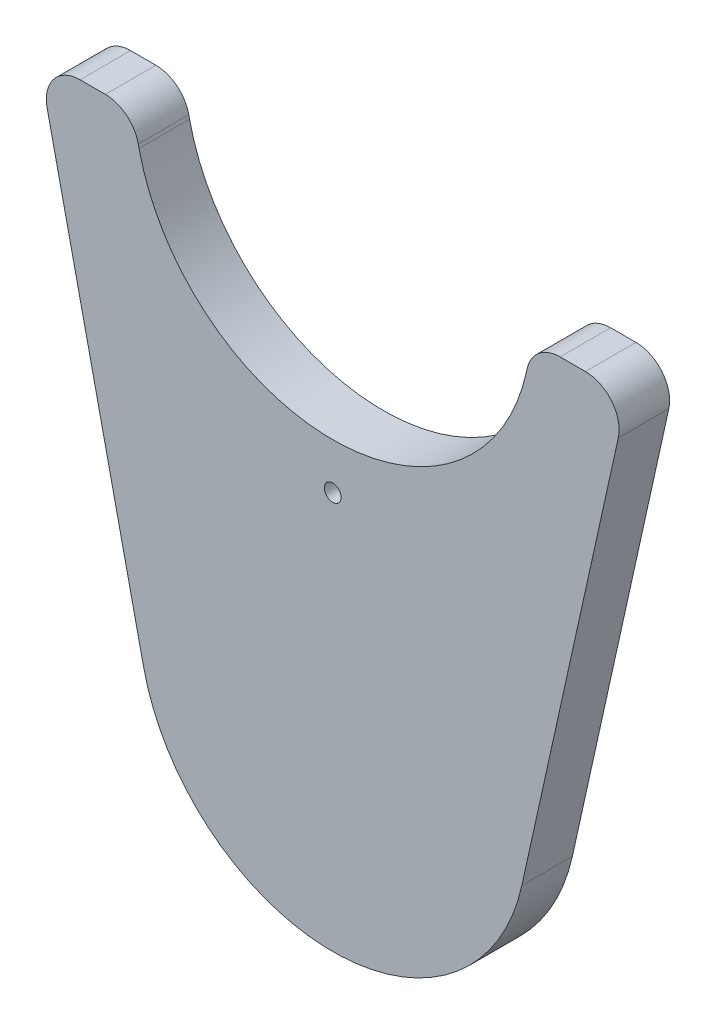
ISO-10303-21;
HEADER;
FILE_DESCRIPTION(('STEP AP214'),'2;1');
FILE_NAME('part.step','',(''),(''),'','','');
FILE_SCHEMA(('AUTOMOTIVE_DESIGN { 1 0 10303 214 1 1 1 1 }'));
ENDSEC;
DATA;
#1=APPLICATION_CONTEXT('core data for automotive mechanical design processes');
#2=APPLICATION_PROTOCOL_DEFINITION('international standard','automotive_design',2000,#1);
#3=PRODUCT_CONTEXT('',#1,'mechanical');
#4=PRODUCT('Part','Part','',(#3));
#5=PRODUCT_RELATED_PRODUCT_CATEGORY('part','',(#4));
#6=PRODUCT_DEFINITION_FORMATION('','',#4);
#7=PRODUCT_DEFINITION_CONTEXT('part definition',#1,'design');
#8=PRODUCT_DEFINITION('design','',#6,#7);
#9=PRODUCT_DEFINITION_SHAPE('','',#8);
#10=(LENGTH_UNIT() NAMED_UNIT(*) SI_UNIT(.MILLI.,.METRE.));
#11=(NAMED_UNIT(*) PLANE_ANGLE_UNIT() SI_UNIT($,.RADIAN.));
#12=(NAMED_UNIT(*) SI_UNIT($,.STERADIAN.) SOLID_ANGLE_UNIT());
#13=UNCERTAINTY_MEASURE_WITH_UNIT(LENGTH_MEASURE(1.E-05),#10,'distance_accuracy_value','');
#14=(GEOMETRIC_REPRESENTATION_CONTEXT(3) GLOBAL_UNCERTAINTY_ASSIGNED_CONTEXT((#13)) GLOBAL_UNIT_ASSIGNED_CONTEXT((#10,
#11,#12)) REPRESENTATION_CONTEXT('',''));
#15=CARTESIAN_POINT('',(0.,0.,0.));
#16=DIRECTION('',(0.,0.,1.));
#17=DIRECTION('',(1.,0.,0.));
#18=AXIS2_PLACEMENT_3D('',#15,#16,#17);
#19=CARTESIAN_POINT('',(0.,0.,15.));
#20=DIRECTION('',(0.,0.,1.));
#21=DIRECTION('',(1.,0.,0.));
#22=AXIS2_PLACEMENT_3D('',#19,#20,#21);
#23=PLANE('',#22);
#24=CARTESIAN_POINT('',(0.,0.,15.));
#25=DIRECTION('',(0.,0.,1.));
#26=DIRECTION('',(1.,0.,0.));
#27=AXIS2_PLACEMENT_3D('',#24,#25,#26);
#28=CIRCLE('',#27,57.5);
#29=CARTESIAN_POINT('',(-56.1416428716496,-12.4244088661055,15.));
#30=VERTEX_POINT('',#29);
#31=CARTESIAN_POINT('',(56.1416428716495,-12.4244088661059,15.));
#32=VERTEX_POINT('',#31);
#33=EDGE_CURVE('E177',#30,#32,#28,.T.);
#34=ORIENTED_EDGE('',*,*,#33,.T.);
#35=DIRECTION('',(0.216076675932276,0.976376397767817,0.));
#36=VECTOR('',#35,1.);
#37=CARTESIAN_POINT('',(56.1416428716495,-12.4244088661059,15.));
#38=LINE('',#37,#36);
#39=CARTESIAN_POINT('',(84.7799694041554,116.982367581485,15.));
#40=VERTEX_POINT('',#39);
#41=EDGE_CURVE('E105',#32,#40,#38,.T.);
#42=ORIENTED_EDGE('',*,*,#41,.T.);
#43=CARTESIAN_POINT('',(75.0162054264772,119.143134340808,15.));
#44=DIRECTION('',(0.,0.,1.));
#45=DIRECTION('',(1.,0.,0.));
#46=AXIS2_PLACEMENT_3D('',#43,#44,#45);
#47=CIRCLE('',#46,10.);
#48=CARTESIAN_POINT('',(75.0162054264772,129.143134340808,15.));
#49=VERTEX_POINT('',#48);
#50=EDGE_CURVE('E204',#40,#49,#47,.T.);
#51=ORIENTED_EDGE('',*,*,#50,.T.);
#52=DIRECTION('',(-1.,0.,0.));
#53=VECTOR('',#52,1.);
#54=CARTESIAN_POINT('',(67.4944002792042,129.143134340808,15.));
#55=LINE('',#54,#53);
#56=CARTESIAN_POINT('',(67.4944002792042,129.143134340808,15.));
#57=VERTEX_POINT('',#56);
#58=EDGE_CURVE('E223',#49,#57,#55,.T.);
#59=ORIENTED_EDGE('',*,*,#58,.T.);
#60=CARTESIAN_POINT('',(67.4944002792041,119.143134340808,15.));
#61=DIRECTION('',(0.,0.,1.));
#62=DIRECTION('',(-1.,0.,0.));
#63=AXIS2_PLACEMENT_3D('',#60,#61,#62);
#64=CIRCLE('',#63,10.0000000000002);
#65=CARTESIAN_POINT('',(57.7306363015258,121.303901100131,15.));
#66=VERTEX_POINT('',#65);
#67=EDGE_CURVE('E220',#57,#66,#64,.T.);
#68=ORIENTED_EDGE('',*,*,#67,.T.);
#69=DIRECTION('',(-0.216076675932268,-0.976376397767819,0.));
#70=VECTOR('',#69,1.);
#71=CARTESIAN_POINT('',(57.5027711046817,120.274256419086,15.));
#72=LINE('',#71,#70);
#73=CARTESIAN_POINT('',(57.5027711046817,120.274256419086,15.));
#74=VERTEX_POINT('',#73);
#75=EDGE_CURVE('E222',#66,#74,#72,.T.);
#76=ORIENTED_EDGE('',*,*,#75,.T.);
#77=CARTESIAN_POINT('',(-0.0005,132.99999999906,15.));
#78=DIRECTION('',(0.,0.,-1.));
#79=DIRECTION('',(1.,0.,0.));
#80=AXIS2_PLACEMENT_3D('',#77,#78,#79);
#81=CIRCLE('',#80,58.8945730725826);
#82=CARTESIAN_POINT('',(-57.4972288953183,120.244730353144,15.));
#83=VERTEX_POINT('',#82);
#84=EDGE_CURVE('E225',#74,#83,#81,.T.);
#85=ORIENTED_EDGE('',*,*,#84,.T.);
#86=DIRECTION('',(-0.216076675932281,0.976376397767816,0.));
#87=VECTOR('',#86,1.);
#88=CARTESIAN_POINT('',(-57.4972288953183,120.244730353144,15.));
#89=LINE('',#88,#87);
#90=CARTESIAN_POINT('',(-57.73162834903,121.303901100131,15.));
#91=VERTEX_POINT('',#90);
#92=EDGE_CURVE('E231',#83,#91,#89,.T.);
#93=ORIENTED_EDGE('',*,*,#92,.T.);
#94=CARTESIAN_POINT('',(-67.495392326708,119.143134340808,15.));
#95=DIRECTION('',(0.,0.,1.));
#96=DIRECTION('',(1.,0.,0.));
#97=AXIS2_PLACEMENT_3D('',#94,#95,#96);
#98=CIRCLE('',#97,10.0000000000002);
#99=CARTESIAN_POINT('',(-67.4953923267081,129.143134340808,15.));
#100=VERTEX_POINT('',#99);
#101=EDGE_CURVE('E136',#91,#100,#98,.T.);
#102=ORIENTED_EDGE('',*,*,#101,.T.);
#103=DIRECTION('',(-1.,0.,0.));
#104=VECTOR('',#103,1.);
#105=CARTESIAN_POINT('',(-75.0162054264772,129.143134340808,15.));
#106=LINE('',#105,#104);
#107=CARTESIAN_POINT('',(-75.0162054264772,129.143134340808,15.));
#108=VERTEX_POINT('',#107);
#109=EDGE_CURVE('E130',#100,#108,#106,.T.);
#110=ORIENTED_EDGE('',*,*,#109,.T.);
#111=CARTESIAN_POINT('',(-75.0162054264772,119.143134340808,15.));
#112=DIRECTION('',(0.,0.,1.));
#113=DIRECTION('',(1.,0.,0.));
#114=AXIS2_PLACEMENT_3D('',#111,#112,#113);
#115=CIRCLE('',#114,10.);
#116=CARTESIAN_POINT('',(-84.7799694041553,116.982367581485,15.));
#117=VERTEX_POINT('',#116);
#118=EDGE_CURVE('E134',#108,#117,#115,.T.);
#119=ORIENTED_EDGE('',*,*,#118,.T.);
#120=DIRECTION('',(0.216076675932276,-0.976376397767817,0.));
#121=VECTOR('',#120,1.);
#122=CARTESIAN_POINT('',(-56.1416428716496,-12.4244088661055,15.));
#123=LINE('',#122,#121);
#124=EDGE_CURVE('E50',#117,#30,#123,.T.);
#125=ORIENTED_EDGE('',*,*,#124,.T.);
#126=EDGE_LOOP('',(#34,#42,#51,#59,#68,#76,#85,#93,#102,#110,#119,#125));
#127=FACE_BOUND('',#126,.T.);
#128=CARTESIAN_POINT('',(0.,60.5,15.));
#129=DIRECTION('',(0.,0.,1.));
#130=DIRECTION('',(1.,0.,0.));
#131=AXIS2_PLACEMENT_3D('',#128,#129,#130);
#132=CIRCLE('',#131,2.5);
#133=CARTESIAN_POINT('',(2.5,60.5,15.));
#134=VERTEX_POINT('',#133);
#135=EDGE_CURVE('E158',#134,#134,#132,.T.);
#136=ORIENTED_EDGE('',*,*,#135,.F.);
#137=EDGE_LOOP('',(#136));
#138=FACE_BOUND('',#137,.T.);
#139=ADVANCED_FACE('F33',(#127,#138),#23,.T.);
#140=CARTESIAN_POINT('',(0.,0.,0.));
#141=DIRECTION('',(0.,0.,1.));
#142=DIRECTION('',(1.,0.,0.));
#143=AXIS2_PLACEMENT_3D('',#140,#141,#142);
#144=PLANE('',#143);
#145=CARTESIAN_POINT('',(0.,0.,0.));
#146=DIRECTION('',(0.,0.,1.));
#147=DIRECTION('',(1.,0.,0.));
#148=AXIS2_PLACEMENT_3D('',#145,#146,#147);
#149=CIRCLE('',#148,57.5);
#150=CARTESIAN_POINT('',(-56.1416428716496,-12.4244088661055,0.));
#151=VERTEX_POINT('',#150);
#152=CARTESIAN_POINT('',(56.1416428716495,-12.4244088661059,0.));
#153=VERTEX_POINT('',#152);
#154=EDGE_CURVE('E154',#151,#153,#149,.T.);
#155=ORIENTED_EDGE('',*,*,#154,.F.);
#156=DIRECTION('',(0.216076675932276,-0.976376397767817,0.));
#157=VECTOR('',#156,1.);
#158=CARTESIAN_POINT('',(-56.1416428716496,-12.4244088661055,0.));
#159=LINE('',#158,#157);
#160=CARTESIAN_POINT('',(-84.7799694041553,116.982367581485,0.));
#161=VERTEX_POINT('',#160);
#162=EDGE_CURVE('E97',#161,#151,#159,.T.);
#163=ORIENTED_EDGE('',*,*,#162,.F.);
#164=CARTESIAN_POINT('',(-75.0162054264772,119.143134340808,0.));
#165=DIRECTION('',(0.,0.,1.));
#166=DIRECTION('',(1.,0.,0.));
#167=AXIS2_PLACEMENT_3D('',#164,#165,#166);
#168=CIRCLE('',#167,10.);
#169=CARTESIAN_POINT('',(-75.0162054264772,129.143134340808,0.));
#170=VERTEX_POINT('',#169);
#171=EDGE_CURVE('E91',#170,#161,#168,.T.);
#172=ORIENTED_EDGE('',*,*,#171,.F.);
#173=DIRECTION('',(-1.,0.,0.));
#174=VECTOR('',#173,1.);
#175=CARTESIAN_POINT('',(-75.0162054264772,129.143134340808,0.));
#176=LINE('',#175,#174);
#177=CARTESIAN_POINT('',(-67.4953923267081,129.143134340808,0.));
#178=VERTEX_POINT('',#177);
#179=EDGE_CURVE('E144',#178,#170,#176,.T.);
#180=ORIENTED_EDGE('',*,*,#179,.F.);
#181=CARTESIAN_POINT('',(-67.495392326708,119.143134340808,0.));
#182=DIRECTION('',(0.,0.,1.));
#183=DIRECTION('',(1.,0.,0.));
#184=AXIS2_PLACEMENT_3D('',#181,#182,#183);
#185=CIRCLE('',#184,10.0000000000002);
#186=CARTESIAN_POINT('',(-57.73162834903,121.303901100131,0.));
#187=VERTEX_POINT('',#186);
#188=EDGE_CURVE('E172',#187,#178,#185,.T.);
#189=ORIENTED_EDGE('',*,*,#188,.F.);
#190=DIRECTION('',(-0.216076675932281,0.976376397767816,0.));
#191=VECTOR('',#190,1.);
#192=CARTESIAN_POINT('',(-57.4972288953183,120.244730353144,0.));
#193=LINE('',#192,#191);
#194=CARTESIAN_POINT('',(-57.4972288953183,120.244730353144,0.));
#195=VERTEX_POINT('',#194);
#196=EDGE_CURVE('E170',#195,#187,#193,.T.);
#197=ORIENTED_EDGE('',*,*,#196,.F.);
#198=CARTESIAN_POINT('',(-0.0005,132.99999999906,0.));
#199=DIRECTION('',(0.,0.,-1.));
#200=DIRECTION('',(1.,0.,0.));
#201=AXIS2_PLACEMENT_3D('',#198,#199,#200);
#202=CIRCLE('',#201,58.8945730725826);
#203=CARTESIAN_POINT('',(57.5027711046817,120.274256419086,0.));
#204=VERTEX_POINT('',#203);
#205=EDGE_CURVE('E168',#204,#195,#202,.T.);
#206=ORIENTED_EDGE('',*,*,#205,.F.);
#207=DIRECTION('',(-0.216076675932268,-0.976376397767819,0.));
#208=VECTOR('',#207,1.);
#209=CARTESIAN_POINT('',(57.5027711046817,120.274256419086,0.));
#210=LINE('',#209,#208);
#211=CARTESIAN_POINT('',(57.7306363015258,121.303901100131,0.));
#212=VERTEX_POINT('',#211);
#213=EDGE_CURVE('E166',#212,#204,#210,.T.);
#214=ORIENTED_EDGE('',*,*,#213,.F.);
#215=CARTESIAN_POINT('',(67.4944002792041,119.143134340808,0.));
#216=DIRECTION('',(0.,0.,1.));
#217=DIRECTION('',(-1.,0.,0.));
#218=AXIS2_PLACEMENT_3D('',#215,#216,#217);
#219=CIRCLE('',#218,10.0000000000002);
#220=CARTESIAN_POINT('',(67.4944002792042,129.143134340808,0.));
#221=VERTEX_POINT('',#220);
#222=EDGE_CURVE('E164',#221,#212,#219,.T.);
#223=ORIENTED_EDGE('',*,*,#222,.F.);
#224=DIRECTION('',(-1.,0.,0.));
#225=VECTOR('',#224,1.);
#226=CARTESIAN_POINT('',(67.4944002792042,129.143134340808,0.));
#227=LINE('',#226,#225);
#228=CARTESIAN_POINT('',(75.0162054264772,129.143134340808,0.));
#229=VERTEX_POINT('',#228);
#230=EDGE_CURVE('E162',#229,#221,#227,.T.);
#231=ORIENTED_EDGE('',*,*,#230,.F.);
#232=CARTESIAN_POINT('',(75.0162054264772,119.143134340808,0.));
#233=DIRECTION('',(0.,0.,1.));
#234=DIRECTION('',(1.,0.,0.));
#235=AXIS2_PLACEMENT_3D('',#232,#233,#234);
#236=CIRCLE('',#235,10.);
#237=CARTESIAN_POINT('',(84.7799694041554,116.982367581485,0.));
#238=VERTEX_POINT('',#237);
#239=EDGE_CURVE('E160',#238,#229,#236,.T.);
#240=ORIENTED_EDGE('',*,*,#239,.F.);
#241=DIRECTION('',(0.216076675932276,0.976376397767817,0.));
#242=VECTOR('',#241,1.);
#243=CARTESIAN_POINT('',(56.1416428716495,-12.4244088661059,0.));
#244=LINE('',#243,#242);
#245=EDGE_CURVE('E157',#153,#238,#244,.T.);
#246=ORIENTED_EDGE('',*,*,#245,.F.);
#247=EDGE_LOOP('',(#155,#163,#172,#180,#189,#197,#206,#214,#223,#231,#240,#246));
#248=FACE_BOUND('',#247,.T.);
#249=CARTESIAN_POINT('',(0.,60.5,0.));
#250=DIRECTION('',(0.,0.,1.));
#251=DIRECTION('',(1.,0.,0.));
#252=AXIS2_PLACEMENT_3D('',#249,#250,#251);
#253=CIRCLE('',#252,2.5);
#254=CARTESIAN_POINT('',(2.5,60.5,0.));
#255=VERTEX_POINT('',#254);
#256=EDGE_CURVE('E378',#255,#255,#253,.T.);
#257=ORIENTED_EDGE('',*,*,#256,.T.);
#258=EDGE_LOOP('',(#257));
#259=FACE_BOUND('',#258,.T.);
#260=ADVANCED_FACE('F208',(#248,#259),#144,.F.);
#261=CARTESIAN_POINT('',(0.,0.,15.));
#262=DIRECTION('',(0.,0.,-1.));
#263=DIRECTION('',(-1.,0.,0.));
#264=AXIS2_PLACEMENT_3D('',#261,#262,#263);
#265=CYLINDRICAL_SURFACE('',#264,57.5);
#266=ORIENTED_EDGE('',*,*,#154,.T.);
#267=DIRECTION('',(0.,0.,-1.));
#268=VECTOR('',#267,1.);
#269=CARTESIAN_POINT('',(56.1416428716495,-12.4244088661059,15.));
#270=LINE('',#269,#268);
#271=EDGE_CURVE('E11',#32,#153,#270,.T.);
#272=ORIENTED_EDGE('',*,*,#271,.F.);
#273=ORIENTED_EDGE('',*,*,#33,.F.);
#274=DIRECTION('',(0.,0.,-1.));
#275=VECTOR('',#274,1.);
#276=CARTESIAN_POINT('',(-56.1416428716496,-12.4244088661055,15.));
#277=LINE('',#276,#275);
#278=EDGE_CURVE('E150',#30,#151,#277,.T.);
#279=ORIENTED_EDGE('',*,*,#278,.T.);
#280=EDGE_LOOP('',(#266,#272,#273,#279));
#281=FACE_BOUND('',#280,.T.);
#282=ADVANCED_FACE('F35',(#281),#265,.T.);
#283=CARTESIAN_POINT('',(56.1416428716495,-12.4244088661059,15.));
#284=DIRECTION('',(-0.976376397767817,0.216076675932276,0.));
#285=DIRECTION('',(-0.216076675932276,-0.976376397767817,0.));
#286=AXIS2_PLACEMENT_3D('',#283,#284,#285);
#287=PLANE('',#286);
#288=ORIENTED_EDGE('',*,*,#245,.T.);
#289=DIRECTION('',(0.,0.,-1.));
#290=VECTOR('',#289,1.);
#291=CARTESIAN_POINT('',(84.7799694041554,116.982367581485,15.));
#292=LINE('',#291,#290);
#293=EDGE_CURVE('E42',#40,#238,#292,.T.);
#294=ORIENTED_EDGE('',*,*,#293,.F.);
#295=ORIENTED_EDGE('',*,*,#41,.F.);
#296=ORIENTED_EDGE('',*,*,#271,.T.);
#297=EDGE_LOOP('',(#288,#294,#295,#296));
#298=FACE_BOUND('',#297,.T.);
#299=ADVANCED_FACE('F265',(#298),#287,.F.);
#300=CARTESIAN_POINT('',(75.0162054264772,119.143134340808,15.));
#301=DIRECTION('',(0.,0.,-1.));
#302=DIRECTION('',(-1.,0.,0.));
#303=AXIS2_PLACEMENT_3D('',#300,#301,#302);
#304=CYLINDRICAL_SURFACE('',#303,10.);
#305=ORIENTED_EDGE('',*,*,#239,.T.);
#306=DIRECTION('',(0.,0.,-1.));
#307=VECTOR('',#306,1.);
#308=CARTESIAN_POINT('',(75.0162054264772,129.143134340808,15.));
#309=LINE('',#308,#307);
#310=EDGE_CURVE('E196',#49,#229,#309,.T.);
#311=ORIENTED_EDGE('',*,*,#310,.F.);
#312=ORIENTED_EDGE('',*,*,#50,.F.);
#313=ORIENTED_EDGE('',*,*,#293,.T.);
#314=EDGE_LOOP('',(#305,#311,#312,#313));
#315=FACE_BOUND('',#314,.T.);
#316=ADVANCED_FACE('F202',(#315),#304,.T.);
#317=CARTESIAN_POINT('',(67.4944002792042,129.143134340808,15.));
#318=DIRECTION('',(0.,-1.,0.));
#319=DIRECTION('',(1.,0.,0.));
#320=AXIS2_PLACEMENT_3D('',#317,#318,#319);
#321=PLANE('',#320);
#322=ORIENTED_EDGE('',*,*,#230,.T.);
#323=DIRECTION('',(0.,0.,-1.));
#324=VECTOR('',#323,1.);
#325=CARTESIAN_POINT('',(67.4944002792042,129.143134340808,15.));
#326=LINE('',#325,#324);
#327=EDGE_CURVE('E193',#57,#221,#326,.T.);
#328=ORIENTED_EDGE('',*,*,#327,.F.);
#329=ORIENTED_EDGE('',*,*,#58,.F.);
#330=ORIENTED_EDGE('',*,*,#310,.T.);
#331=EDGE_LOOP('',(#322,#328,#329,#330));
#332=FACE_BOUND('',#331,.T.);
#333=ADVANCED_FACE('F214',(#332),#321,.F.);
#334=CARTESIAN_POINT('',(67.4944002792041,119.143134340808,15.));
#335=DIRECTION('',(0.,0.,-1.));
#336=DIRECTION('',(-1.,0.,0.));
#337=AXIS2_PLACEMENT_3D('',#334,#335,#336);
#338=CYLINDRICAL_SURFACE('',#337,10.0000000000002);
#339=ORIENTED_EDGE('',*,*,#222,.T.);
#340=DIRECTION('',(0.,0.,-1.));
#341=VECTOR('',#340,1.);
#342=CARTESIAN_POINT('',(57.7306363015258,121.303901100131,15.));
#343=LINE('',#342,#341);
#344=EDGE_CURVE('E190',#66,#212,#343,.T.);
#345=ORIENTED_EDGE('',*,*,#344,.F.);
#346=ORIENTED_EDGE('',*,*,#67,.F.);
#347=ORIENTED_EDGE('',*,*,#327,.T.);
#348=EDGE_LOOP('',(#339,#345,#346,#347));
#349=FACE_BOUND('',#348,.T.);
#350=ADVANCED_FACE('F218',(#349),#338,.T.);
#351=CARTESIAN_POINT('',(57.5027711046817,120.274256419086,15.));
#352=DIRECTION('',(0.976376397767819,-0.216076675932268,0.));
#353=DIRECTION('',(0.216076675932268,0.976376397767819,0.));
#354=AXIS2_PLACEMENT_3D('',#351,#352,#353);
#355=PLANE('',#354);
#356=ORIENTED_EDGE('',*,*,#213,.T.);
#357=DIRECTION('',(0.,0.,-1.));
#358=VECTOR('',#357,1.);
#359=CARTESIAN_POINT('',(57.5027711046817,120.274256419086,15.));
#360=LINE('',#359,#358);
#361=EDGE_CURVE('E187',#74,#204,#360,.T.);
#362=ORIENTED_EDGE('',*,*,#361,.F.);
#363=ORIENTED_EDGE('',*,*,#75,.F.);
#364=ORIENTED_EDGE('',*,*,#344,.T.);
#365=EDGE_LOOP('',(#356,#362,#363,#364));
#366=FACE_BOUND('',#365,.T.);
#367=ADVANCED_FACE('F278',(#366),#355,.F.);
#368=CARTESIAN_POINT('',(-0.0005,132.99999999906,15.));
#369=DIRECTION('',(0.,0.,-1.));
#370=DIRECTION('',(-1.,0.,0.));
#371=AXIS2_PLACEMENT_3D('',#368,#369,#370);
#372=CYLINDRICAL_SURFACE('',#371,58.8945730725826);
#373=ORIENTED_EDGE('',*,*,#205,.T.);
#374=DIRECTION('',(0.,0.,-1.));
#375=VECTOR('',#374,1.);
#376=CARTESIAN_POINT('',(-57.4972288953183,120.244730353144,15.));
#377=LINE('',#376,#375);
#378=EDGE_CURVE('E184',#83,#195,#377,.T.);
#379=ORIENTED_EDGE('',*,*,#378,.F.);
#380=ORIENTED_EDGE('',*,*,#84,.F.);
#381=ORIENTED_EDGE('',*,*,#361,.T.);
#382=EDGE_LOOP('',(#373,#379,#380,#381));
#383=FACE_BOUND('',#382,.T.);
#384=ADVANCED_FACE('F281',(#383),#372,.F.);
#385=CARTESIAN_POINT('',(-57.4972288953183,120.244730353144,15.));
#386=DIRECTION('',(-0.976376397767816,-0.216076675932281,0.));
#387=DIRECTION('',(0.216076675932281,-0.976376397767816,0.));
#388=AXIS2_PLACEMENT_3D('',#385,#386,#387);
#389=PLANE('',#388);
#390=ORIENTED_EDGE('',*,*,#196,.T.);
#391=DIRECTION('',(0.,0.,-1.));
#392=VECTOR('',#391,1.);
#393=CARTESIAN_POINT('',(-57.73162834903,121.303901100131,15.));
#394=LINE('',#393,#392);
#395=EDGE_CURVE('E181',#91,#187,#394,.T.);
#396=ORIENTED_EDGE('',*,*,#395,.F.);
#397=ORIENTED_EDGE('',*,*,#92,.F.);
#398=ORIENTED_EDGE('',*,*,#378,.T.);
#399=EDGE_LOOP('',(#390,#396,#397,#398));
#400=FACE_BOUND('',#399,.T.);
#401=ADVANCED_FACE('F237',(#400),#389,.F.);
#402=CARTESIAN_POINT('',(-67.495392326708,119.143134340808,15.));
#403=DIRECTION('',(0.,0.,-1.));
#404=DIRECTION('',(-1.,0.,0.));
#405=AXIS2_PLACEMENT_3D('',#402,#403,#404);
#406=CYLINDRICAL_SURFACE('',#405,10.0000000000002);
#407=ORIENTED_EDGE('',*,*,#188,.T.);
#408=DIRECTION('',(0.,0.,-1.));
#409=VECTOR('',#408,1.);
#410=CARTESIAN_POINT('',(-67.4953923267081,129.143134340808,15.));
#411=LINE('',#410,#409);
#412=EDGE_CURVE('E145',#100,#178,#411,.T.);
#413=ORIENTED_EDGE('',*,*,#412,.F.);
#414=ORIENTED_EDGE('',*,*,#101,.F.);
#415=ORIENTED_EDGE('',*,*,#395,.T.);
#416=EDGE_LOOP('',(#407,#413,#414,#415));
#417=FACE_BOUND('',#416,.T.);
#418=ADVANCED_FACE('F241',(#417),#406,.T.);
#419=CARTESIAN_POINT('',(-75.0162054264772,129.143134340808,15.));
#420=DIRECTION('',(0.,-1.,0.));
#421=DIRECTION('',(1.,0.,0.));
#422=AXIS2_PLACEMENT_3D('',#419,#420,#421);
#423=PLANE('',#422);
#424=ORIENTED_EDGE('',*,*,#179,.T.);
#425=DIRECTION('',(0.,0.,-1.));
#426=VECTOR('',#425,1.);
#427=CARTESIAN_POINT('',(-75.0162054264772,129.143134340808,15.));
#428=LINE('',#427,#426);
#429=EDGE_CURVE('E141',#108,#170,#428,.T.);
#430=ORIENTED_EDGE('',*,*,#429,.F.);
#431=ORIENTED_EDGE('',*,*,#109,.F.);
#432=ORIENTED_EDGE('',*,*,#412,.T.);
#433=EDGE_LOOP('',(#424,#430,#431,#432));
#434=FACE_BOUND('',#433,.T.);
#435=ADVANCED_FACE('F142',(#434),#423,.F.);
#436=CARTESIAN_POINT('',(-75.0162054264772,119.143134340808,15.));
#437=DIRECTION('',(0.,0.,-1.));
#438=DIRECTION('',(-1.,0.,0.));
#439=AXIS2_PLACEMENT_3D('',#436,#437,#438);
#440=CYLINDRICAL_SURFACE('',#439,10.);
#441=ORIENTED_EDGE('',*,*,#171,.T.);
#442=DIRECTION('',(0.,0.,-1.));
#443=VECTOR('',#442,1.);
#444=CARTESIAN_POINT('',(-84.7799694041553,116.982367581485,15.));
#445=LINE('',#444,#443);
#446=EDGE_CURVE('E146',#117,#161,#445,.T.);
#447=ORIENTED_EDGE('',*,*,#446,.F.);
#448=ORIENTED_EDGE('',*,*,#118,.F.);
#449=ORIENTED_EDGE('',*,*,#429,.T.);
#450=EDGE_LOOP('',(#441,#447,#448,#449));
#451=FACE_BOUND('',#450,.T.);
#452=ADVANCED_FACE('F148',(#451),#440,.T.);
#453=CARTESIAN_POINT('',(-56.1416428716496,-12.4244088661055,15.));
#454=DIRECTION('',(0.976376397767817,0.216076675932276,0.));
#455=DIRECTION('',(-0.216076675932276,0.976376397767817,0.));
#456=AXIS2_PLACEMENT_3D('',#453,#454,#455);
#457=PLANE('',#456);
#458=ORIENTED_EDGE('',*,*,#162,.T.);
#459=ORIENTED_EDGE('',*,*,#278,.F.);
#460=ORIENTED_EDGE('',*,*,#124,.F.);
#461=ORIENTED_EDGE('',*,*,#446,.T.);
#462=EDGE_LOOP('',(#458,#459,#460,#461));
#463=FACE_BOUND('',#462,.T.);
#464=ADVANCED_FACE('F245',(#463),#457,.F.);
#465=CARTESIAN_POINT('',(0.,60.5,15.));
#466=DIRECTION('',(0.,0.,-1.));
#467=DIRECTION('',(-1.,0.,0.));
#468=AXIS2_PLACEMENT_3D('',#465,#466,#467);
#469=CYLINDRICAL_SURFACE('',#468,2.5);
#470=ORIENTED_EDGE('',*,*,#135,.T.);
#471=EDGE_LOOP('',(#470));
#472=FACE_BOUND('',#471,.T.);
#473=ORIENTED_EDGE('',*,*,#256,.F.);
#474=EDGE_LOOP('',(#473));
#475=FACE_BOUND('',#474,.T.);
#476=ADVANCED_FACE('F247',(#472,#475),#469,.F.);
#477=CLOSED_SHELL('',(#139,#260,#282,#299,#316,#333,#350,#367,#384,#401,#418,#435,#452,#464,#476));
#478=MANIFOLD_SOLID_BREP('B2',#477);
#479=ADVANCED_BREP_SHAPE_REPRESENTATION('',(#18,#478),#14);
#480=SHAPE_DEFINITION_REPRESENTATION(#9,#479);
ENDSEC;
END-ISO-10303-21;
